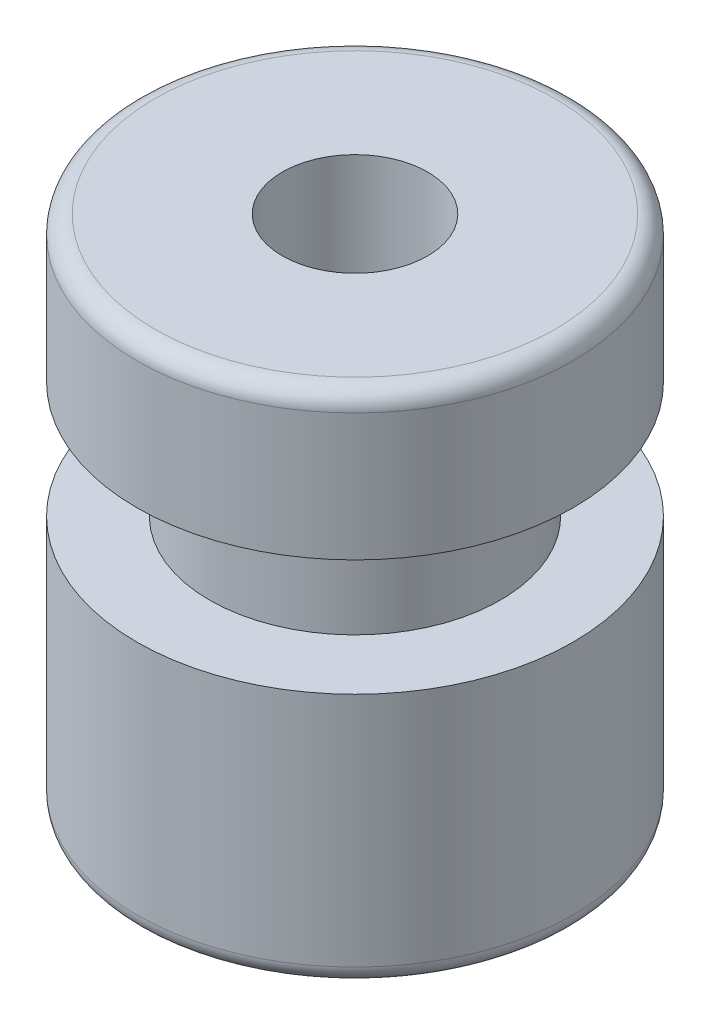
ISO-10303-21;
HEADER;
FILE_DESCRIPTION(('STEP AP214'),'2;1');
FILE_NAME('part.step','',(''),(''),'','','');
FILE_SCHEMA(('AUTOMOTIVE_DESIGN { 1 0 10303 214 1 1 1 1 }'));
ENDSEC;
DATA;
#1=APPLICATION_CONTEXT('core data for automotive mechanical design processes');
#2=APPLICATION_PROTOCOL_DEFINITION('international standard','automotive_design',2000,#1);
#3=PRODUCT_CONTEXT('',#1,'mechanical');
#4=PRODUCT('Part','Part','',(#3));
#5=PRODUCT_RELATED_PRODUCT_CATEGORY('part','',(#4));
#6=PRODUCT_DEFINITION_FORMATION('','',#4);
#7=PRODUCT_DEFINITION_CONTEXT('part definition',#1,'design');
#8=PRODUCT_DEFINITION('design','',#6,#7);
#9=PRODUCT_DEFINITION_SHAPE('','',#8);
#10=(LENGTH_UNIT() NAMED_UNIT(*) SI_UNIT(.MILLI.,.METRE.));
#11=(NAMED_UNIT(*) PLANE_ANGLE_UNIT() SI_UNIT($,.RADIAN.));
#12=(NAMED_UNIT(*) SI_UNIT($,.STERADIAN.) SOLID_ANGLE_UNIT());
#13=UNCERTAINTY_MEASURE_WITH_UNIT(LENGTH_MEASURE(1.E-05),#10,'distance_accuracy_value','');
#14=(GEOMETRIC_REPRESENTATION_CONTEXT(3) GLOBAL_UNCERTAINTY_ASSIGNED_CONTEXT((#13)) GLOBAL_UNIT_ASSIGNED_CONTEXT((#10,
#11,#12)) REPRESENTATION_CONTEXT('',''));
#15=CARTESIAN_POINT('',(0.,0.,0.));
#16=DIRECTION('',(0.,0.,1.));
#17=DIRECTION('',(1.,0.,0.));
#18=AXIS2_PLACEMENT_3D('',#15,#16,#17);
#19=CARTESIAN_POINT('',(0.,3.5,0.));
#20=DIRECTION('',(0.,1.,0.));
#21=DIRECTION('',(0.,0.,1.));
#22=AXIS2_PLACEMENT_3D('',#19,#20,#21);
#23=PLANE('',#22);
#24=CARTESIAN_POINT('',(0.,3.5,0.));
#25=DIRECTION('',(0.,1.,0.));
#26=DIRECTION('',(0.,0.,1.));
#27=AXIS2_PLACEMENT_3D('',#24,#25,#26);
#28=CIRCLE('',#27,3.);
#29=CARTESIAN_POINT('',(0.,3.5,3.));
#30=VERTEX_POINT('',#29);
#31=EDGE_CURVE('E61',#30,#30,#28,.T.);
#32=ORIENTED_EDGE('',*,*,#31,.T.);
#33=EDGE_LOOP('',(#32));
#34=FACE_BOUND('',#33,.T.);
#35=CARTESIAN_POINT('',(0.,3.5,0.));
#36=DIRECTION('',(0.,1.,0.));
#37=DIRECTION('',(0.,0.,1.));
#38=AXIS2_PLACEMENT_3D('',#35,#36,#37);
#39=CIRCLE('',#38,2.);
#40=CARTESIAN_POINT('',(0.,3.5,2.));
#41=VERTEX_POINT('',#40);
#42=EDGE_CURVE('E70',#41,#41,#39,.T.);
#43=ORIENTED_EDGE('',*,*,#42,.F.);
#44=EDGE_LOOP('',(#43));
#45=FACE_BOUND('',#44,.T.);
#46=ADVANCED_FACE('F37',(#34,#45),#23,.T.);
#47=CARTESIAN_POINT('',(0.,0.,0.));
#48=DIRECTION('',(0.,1.,0.));
#49=DIRECTION('',(0.,0.,1.));
#50=AXIS2_PLACEMENT_3D('',#47,#48,#49);
#51=PLANE('',#50);
#52=CARTESIAN_POINT('',(0.,0.,0.));
#53=DIRECTION('',(0.,1.,0.));
#54=DIRECTION('',(0.,0.,1.));
#55=AXIS2_PLACEMENT_3D('',#52,#53,#54);
#56=CIRCLE('',#55,2.75);
#57=CARTESIAN_POINT('',(0.,0.,2.75));
#58=VERTEX_POINT('',#57);
#59=EDGE_CURVE('E50',#58,#58,#56,.F.);
#60=ORIENTED_EDGE('',*,*,#59,.T.);
#61=EDGE_LOOP('',(#60));
#62=FACE_BOUND('',#61,.T.);
#63=CARTESIAN_POINT('',(0.,0.,0.));
#64=DIRECTION('',(0.,1.,0.));
#65=DIRECTION('',(0.,0.,1.));
#66=AXIS2_PLACEMENT_3D('',#63,#64,#65);
#67=CIRCLE('',#66,1.);
#68=CARTESIAN_POINT('',(0.,0.,1.));
#69=VERTEX_POINT('',#68);
#70=EDGE_CURVE('E65',#69,#69,#67,.T.);
#71=ORIENTED_EDGE('',*,*,#70,.T.);
#72=EDGE_LOOP('',(#71));
#73=FACE_BOUND('',#72,.T.);
#74=ADVANCED_FACE('F103',(#62,#73),#51,.F.);
#75=CARTESIAN_POINT('',(0.,3.5,0.));
#76=DIRECTION('',(0.,-1.,0.));
#77=DIRECTION('',(0.,0.,-1.));
#78=AXIS2_PLACEMENT_3D('',#75,#76,#77);
#79=CYLINDRICAL_SURFACE('',#78,3.);
#80=CARTESIAN_POINT('',(0.,0.25,0.));
#81=DIRECTION('',(0.,1.,0.));
#82=DIRECTION('',(0.,0.,1.));
#83=AXIS2_PLACEMENT_3D('',#80,#81,#82);
#84=CIRCLE('',#83,3.);
#85=CARTESIAN_POINT('',(0.,0.25,3.));
#86=VERTEX_POINT('',#85);
#87=EDGE_CURVE('E55',#86,#86,#84,.T.);
#88=ORIENTED_EDGE('',*,*,#87,.T.);
#89=EDGE_LOOP('',(#88));
#90=FACE_BOUND('',#89,.T.);
#91=ORIENTED_EDGE('',*,*,#31,.F.);
#92=EDGE_LOOP('',(#91));
#93=FACE_BOUND('',#92,.T.);
#94=ADVANCED_FACE('F109',(#90,#93),#79,.T.);
#95=CARTESIAN_POINT('',(0.,3.5,0.));
#96=DIRECTION('',(0.,-1.,0.));
#97=DIRECTION('',(0.,0.,-1.));
#98=AXIS2_PLACEMENT_3D('',#95,#96,#97);
#99=CYLINDRICAL_SURFACE('',#98,1.);
#100=ORIENTED_EDGE('',*,*,#70,.F.);
#101=EDGE_LOOP('',(#100));
#102=FACE_BOUND('',#101,.T.);
#103=CARTESIAN_POINT('',(0.,7.1,0.));
#104=DIRECTION('',(0.,1.,0.));
#105=DIRECTION('',(0.,0.,1.));
#106=AXIS2_PLACEMENT_3D('',#103,#104,#105);
#107=CIRCLE('',#106,1.);
#108=CARTESIAN_POINT('',(0.,7.1,1.));
#109=VERTEX_POINT('',#108);
#110=EDGE_CURVE('E81',#109,#109,#107,.T.);
#111=ORIENTED_EDGE('',*,*,#110,.T.);
#112=EDGE_LOOP('',(#111));
#113=FACE_BOUND('',#112,.T.);
#114=ADVANCED_FACE('F86',(#102,#113),#99,.F.);
#115=CARTESIAN_POINT('',(0.,5.1,0.));
#116=DIRECTION('',(0.,-1.,0.));
#117=DIRECTION('',(0.,0.,-1.));
#118=AXIS2_PLACEMENT_3D('',#115,#116,#117);
#119=CYLINDRICAL_SURFACE('',#118,2.);
#120=CARTESIAN_POINT('',(0.,5.1,0.));
#121=DIRECTION('',(0.,1.,0.));
#122=DIRECTION('',(0.,0.,1.));
#123=AXIS2_PLACEMENT_3D('',#120,#121,#122);
#124=CIRCLE('',#123,2.);
#125=CARTESIAN_POINT('',(0.,5.1,2.));
#126=VERTEX_POINT('',#125);
#127=EDGE_CURVE('E69',#126,#126,#124,.T.);
#128=ORIENTED_EDGE('',*,*,#127,.F.);
#129=EDGE_LOOP('',(#128));
#130=FACE_BOUND('',#129,.T.);
#131=ORIENTED_EDGE('',*,*,#42,.T.);
#132=EDGE_LOOP('',(#131));
#133=FACE_BOUND('',#132,.T.);
#134=ADVANCED_FACE('F91',(#130,#133),#119,.T.);
#135=CARTESIAN_POINT('',(0.,7.1,0.));
#136=DIRECTION('',(0.,1.,0.));
#137=DIRECTION('',(0.,0.,1.));
#138=AXIS2_PLACEMENT_3D('',#135,#136,#137);
#139=PLANE('',#138);
#140=CARTESIAN_POINT('',(0.,7.1,0.));
#141=DIRECTION('',(0.,1.,0.));
#142=DIRECTION('',(0.,0.,1.));
#143=AXIS2_PLACEMENT_3D('',#140,#141,#142);
#144=CIRCLE('',#143,2.75);
#145=CARTESIAN_POINT('',(0.,7.1,2.75));
#146=VERTEX_POINT('',#145);
#147=EDGE_CURVE('E45',#146,#146,#144,.T.);
#148=ORIENTED_EDGE('',*,*,#147,.T.);
#149=EDGE_LOOP('',(#148));
#150=FACE_BOUND('',#149,.T.);
#151=ORIENTED_EDGE('',*,*,#110,.F.);
#152=EDGE_LOOP('',(#151));
#153=FACE_BOUND('',#152,.T.);
#154=ADVANCED_FACE('F88',(#150,#153),#139,.T.);
#155=CARTESIAN_POINT('',(0.,5.1,0.));
#156=DIRECTION('',(0.,1.,0.));
#157=DIRECTION('',(0.,0.,1.));
#158=AXIS2_PLACEMENT_3D('',#155,#156,#157);
#159=PLANE('',#158);
#160=ORIENTED_EDGE('',*,*,#127,.T.);
#161=EDGE_LOOP('',(#160));
#162=FACE_BOUND('',#161,.T.);
#163=CARTESIAN_POINT('',(0.,5.1,0.));
#164=DIRECTION('',(0.,1.,0.));
#165=DIRECTION('',(0.,0.,1.));
#166=AXIS2_PLACEMENT_3D('',#163,#164,#165);
#167=CIRCLE('',#166,3.);
#168=CARTESIAN_POINT('',(0.,5.1,3.));
#169=VERTEX_POINT('',#168);
#170=EDGE_CURVE('E74',#169,#169,#167,.T.);
#171=ORIENTED_EDGE('',*,*,#170,.F.);
#172=EDGE_LOOP('',(#171));
#173=FACE_BOUND('',#172,.T.);
#174=ADVANCED_FACE('F90',(#162,#173),#159,.F.);
#175=CARTESIAN_POINT('',(0.,7.1,0.));
#176=DIRECTION('',(0.,-1.,0.));
#177=DIRECTION('',(0.,0.,-1.));
#178=AXIS2_PLACEMENT_3D('',#175,#176,#177);
#179=CYLINDRICAL_SURFACE('',#178,3.);
#180=CARTESIAN_POINT('',(0.,6.85,0.));
#181=DIRECTION('',(0.,1.,0.));
#182=DIRECTION('',(0.,0.,1.));
#183=AXIS2_PLACEMENT_3D('',#180,#181,#182);
#184=CIRCLE('',#183,3.);
#185=CARTESIAN_POINT('',(0.,6.85,3.));
#186=VERTEX_POINT('',#185);
#187=EDGE_CURVE('E10',#186,#186,#184,.F.);
#188=ORIENTED_EDGE('',*,*,#187,.T.);
#189=EDGE_LOOP('',(#188));
#190=FACE_BOUND('',#189,.T.);
#191=ORIENTED_EDGE('',*,*,#170,.T.);
#192=EDGE_LOOP('',(#191));
#193=FACE_BOUND('',#192,.T.);
#194=ADVANCED_FACE('F97',(#190,#193),#179,.T.);
#195=CARTESIAN_POINT('',(0.,0.25,0.));
#196=DIRECTION('',(0.,1.,0.));
#197=DIRECTION('',(0.,0.,1.));
#198=AXIS2_PLACEMENT_3D('',#195,#196,#197);
#199=TOROIDAL_SURFACE('',#198,2.75,0.25);
#200=ORIENTED_EDGE('',*,*,#59,.F.);
#201=EDGE_LOOP('',(#200));
#202=FACE_BOUND('',#201,.T.);
#203=ORIENTED_EDGE('',*,*,#87,.F.);
#204=EDGE_LOOP('',(#203));
#205=FACE_BOUND('',#204,.T.);
#206=ADVANCED_FACE('F117',(#202,#205),#199,.T.);
#207=CARTESIAN_POINT('',(0.,6.85,0.));
#208=DIRECTION('',(0.,1.,0.));
#209=DIRECTION('',(0.,0.,1.));
#210=AXIS2_PLACEMENT_3D('',#207,#208,#209);
#211=TOROIDAL_SURFACE('',#210,2.75,0.25);
#212=ORIENTED_EDGE('',*,*,#187,.F.);
#213=EDGE_LOOP('',(#212));
#214=FACE_BOUND('',#213,.T.);
#215=ORIENTED_EDGE('',*,*,#147,.F.);
#216=EDGE_LOOP('',(#215));
#217=FACE_BOUND('',#216,.T.);
#218=ADVANCED_FACE('F39',(#214,#217),#211,.T.);
#219=CLOSED_SHELL('',(#46,#74,#94,#114,#134,#154,#174,#194,#206,#218));
#220=MANIFOLD_SOLID_BREP('B2',#219);
#221=ADVANCED_BREP_SHAPE_REPRESENTATION('',(#18,#220),#14);
#222=SHAPE_DEFINITION_REPRESENTATION(#9,#221);
ENDSEC;
END-ISO-10303-21;
